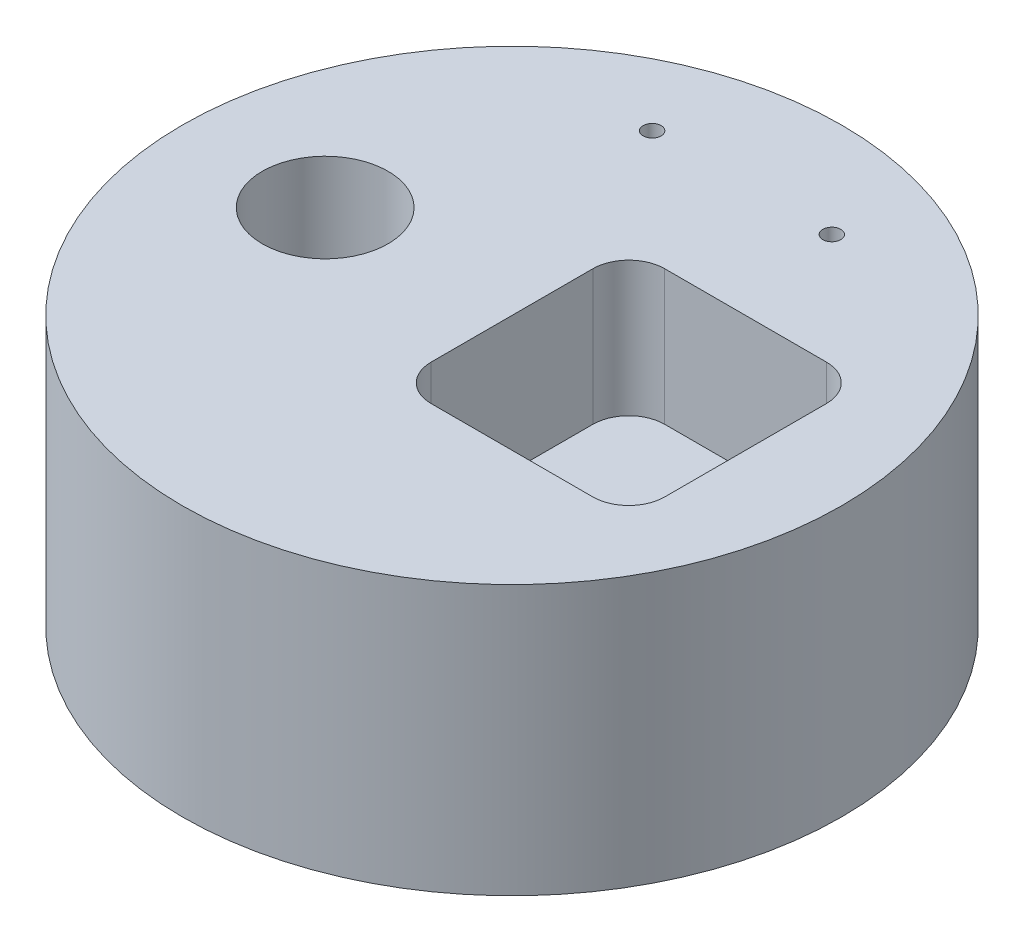
ISO-10303-21;
HEADER;
FILE_DESCRIPTION(('STEP AP214'),'2;1');
FILE_NAME('part.step','',(''),(''),'','','');
FILE_SCHEMA(('AUTOMOTIVE_DESIGN { 1 0 10303 214 1 1 1 1 }'));
ENDSEC;
DATA;
#1=APPLICATION_CONTEXT('core data for automotive mechanical design processes');
#2=APPLICATION_PROTOCOL_DEFINITION('international standard','automotive_design',2000,#1);
#3=PRODUCT_CONTEXT('',#1,'mechanical');
#4=PRODUCT('Part','Part','',(#3));
#5=PRODUCT_RELATED_PRODUCT_CATEGORY('part','',(#4));
#6=PRODUCT_DEFINITION_FORMATION('','',#4);
#7=PRODUCT_DEFINITION_CONTEXT('part definition',#1,'design');
#8=PRODUCT_DEFINITION('design','',#6,#7);
#9=PRODUCT_DEFINITION_SHAPE('','',#8);
#10=(LENGTH_UNIT() NAMED_UNIT(*) SI_UNIT(.MILLI.,.METRE.));
#11=(NAMED_UNIT(*) PLANE_ANGLE_UNIT() SI_UNIT($,.RADIAN.));
#12=(NAMED_UNIT(*) SI_UNIT($,.STERADIAN.) SOLID_ANGLE_UNIT());
#13=UNCERTAINTY_MEASURE_WITH_UNIT(LENGTH_MEASURE(1.E-05),#10,'distance_accuracy_value','');
#14=(GEOMETRIC_REPRESENTATION_CONTEXT(3) GLOBAL_UNCERTAINTY_ASSIGNED_CONTEXT((#13)) GLOBAL_UNIT_ASSIGNED_CONTEXT((#10,
#11,#12)) REPRESENTATION_CONTEXT('',''));
#15=CARTESIAN_POINT('',(0.,0.,0.));
#16=DIRECTION('',(0.,0.,1.));
#17=DIRECTION('',(1.,0.,0.));
#18=AXIS2_PLACEMENT_3D('',#15,#16,#17);
#19=CARTESIAN_POINT('',(0.,38.1,0.));
#20=DIRECTION('',(0.,-1.,0.));
#21=DIRECTION('',(0.,0.,-1.));
#22=AXIS2_PLACEMENT_3D('',#19,#20,#21);
#23=CYLINDRICAL_SURFACE('',#22,46.609);
#24=CARTESIAN_POINT('',(0.,38.1,0.));
#25=DIRECTION('',(0.,1.,0.));
#26=DIRECTION('',(0.,0.,1.));
#27=AXIS2_PLACEMENT_3D('',#24,#25,#26);
#28=CIRCLE('',#27,46.609);
#29=CARTESIAN_POINT('',(0.,38.1,46.609));
#30=VERTEX_POINT('',#29);
#31=EDGE_CURVE('E153',#30,#30,#28,.T.);
#32=ORIENTED_EDGE('',*,*,#31,.F.);
#33=EDGE_LOOP('',(#32));
#34=FACE_BOUND('',#33,.T.);
#35=CARTESIAN_POINT('',(0.,0.,0.));
#36=DIRECTION('',(0.,1.,0.));
#37=DIRECTION('',(0.,0.,1.));
#38=AXIS2_PLACEMENT_3D('',#35,#36,#37);
#39=CIRCLE('',#38,46.609);
#40=CARTESIAN_POINT('',(0.,0.,46.609));
#41=VERTEX_POINT('',#40);
#42=EDGE_CURVE('E148',#41,#41,#39,.T.);
#43=ORIENTED_EDGE('',*,*,#42,.T.);
#44=EDGE_LOOP('',(#43));
#45=FACE_BOUND('',#44,.T.);
#46=ADVANCED_FACE('F33',(#34,#45),#23,.T.);
#47=CARTESIAN_POINT('',(0.,38.1,0.));
#48=DIRECTION('',(0.,1.,0.));
#49=DIRECTION('',(0.,0.,1.));
#50=AXIS2_PLACEMENT_3D('',#47,#48,#49);
#51=PLANE('',#50);
#52=DIRECTION('',(0.,0.,1.));
#53=VECTOR('',#52,1.);
#54=CARTESIAN_POINT('',(0.,38.1,-16.51));
#55=LINE('',#54,#53);
#56=CARTESIAN_POINT('',(0.,38.1,-11.43));
#57=VERTEX_POINT('',#56);
#58=CARTESIAN_POINT('',(0.,38.1,11.43));
#59=VERTEX_POINT('',#58);
#60=EDGE_CURVE('E123',#57,#59,#55,.T.);
#61=ORIENTED_EDGE('',*,*,#60,.F.);
#62=CARTESIAN_POINT('',(5.08,38.1,-11.43));
#63=DIRECTION('',(0.,1.,0.));
#64=DIRECTION('',(0.,0.,1.));
#65=AXIS2_PLACEMENT_3D('',#62,#63,#64);
#66=CIRCLE('',#65,5.08);
#67=CARTESIAN_POINT('',(5.08,38.1,-16.51));
#68=VERTEX_POINT('',#67);
#69=EDGE_CURVE('E11',#57,#68,#66,.F.);
#70=ORIENTED_EDGE('',*,*,#69,.T.);
#71=DIRECTION('',(-1.,0.,0.));
#72=VECTOR('',#71,1.);
#73=CARTESIAN_POINT('',(0.,38.1,-16.51));
#74=LINE('',#73,#72);
#75=CARTESIAN_POINT('',(27.94,38.1,-16.51));
#76=VERTEX_POINT('',#75);
#77=EDGE_CURVE('E126',#76,#68,#74,.T.);
#78=ORIENTED_EDGE('',*,*,#77,.F.);
#79=CARTESIAN_POINT('',(27.94,38.1,-11.43));
#80=DIRECTION('',(0.,1.,0.));
#81=DIRECTION('',(0.,0.,1.));
#82=AXIS2_PLACEMENT_3D('',#79,#80,#81);
#83=CIRCLE('',#82,5.08);
#84=CARTESIAN_POINT('',(33.02,38.1,-11.43));
#85=VERTEX_POINT('',#84);
#86=EDGE_CURVE('E41',#76,#85,#83,.F.);
#87=ORIENTED_EDGE('',*,*,#86,.T.);
#88=DIRECTION('',(0.,0.,-1.));
#89=VECTOR('',#88,1.);
#90=CARTESIAN_POINT('',(33.02,38.1,-16.51));
#91=LINE('',#90,#89);
#92=CARTESIAN_POINT('',(33.02,38.1,11.43));
#93=VERTEX_POINT('',#92);
#94=EDGE_CURVE('E122',#93,#85,#91,.T.);
#95=ORIENTED_EDGE('',*,*,#94,.F.);
#96=CARTESIAN_POINT('',(27.94,38.1,11.43));
#97=DIRECTION('',(0.,1.,0.));
#98=DIRECTION('',(0.,0.,1.));
#99=AXIS2_PLACEMENT_3D('',#96,#97,#98);
#100=CIRCLE('',#99,5.08);
#101=CARTESIAN_POINT('',(27.94,38.1,16.51));
#102=VERTEX_POINT('',#101);
#103=EDGE_CURVE('E105',#93,#102,#100,.F.);
#104=ORIENTED_EDGE('',*,*,#103,.T.);
#105=DIRECTION('',(1.,0.,0.));
#106=VECTOR('',#105,1.);
#107=CARTESIAN_POINT('',(0.,38.1,16.51));
#108=LINE('',#107,#106);
#109=CARTESIAN_POINT('',(5.08,38.1,16.51));
#110=VERTEX_POINT('',#109);
#111=EDGE_CURVE('E112',#110,#102,#108,.T.);
#112=ORIENTED_EDGE('',*,*,#111,.F.);
#113=CARTESIAN_POINT('',(5.08,38.1,11.43));
#114=DIRECTION('',(0.,1.,0.));
#115=DIRECTION('',(0.,0.,1.));
#116=AXIS2_PLACEMENT_3D('',#113,#114,#115);
#117=CIRCLE('',#116,5.08);
#118=EDGE_CURVE('E97',#110,#59,#117,.F.);
#119=ORIENTED_EDGE('',*,*,#118,.T.);
#120=EDGE_LOOP('',(#61,#70,#78,#87,#95,#104,#112,#119));
#121=FACE_BOUND('',#120,.T.);
#122=CARTESIAN_POINT('',(-26.4099587944115,38.1,0.));
#123=DIRECTION('',(0.,1.,0.));
#124=DIRECTION('',(0.,0.,1.));
#125=AXIS2_PLACEMENT_3D('',#122,#123,#124);
#126=CIRCLE('',#125,8.89);
#127=CARTESIAN_POINT('',(-26.4099587944115,38.1,8.89));
#128=VERTEX_POINT('',#127);
#129=EDGE_CURVE('E133',#128,#128,#126,.T.);
#130=ORIENTED_EDGE('',*,*,#129,.F.);
#131=EDGE_LOOP('',(#130));
#132=FACE_BOUND('',#131,.T.);
#133=CARTESIAN_POINT('',(12.7,38.1,-32.512));
#134=DIRECTION('',(0.,1.,0.));
#135=DIRECTION('',(0.,0.,1.));
#136=AXIS2_PLACEMENT_3D('',#133,#134,#135);
#137=CIRCLE('',#136,1.27);
#138=CARTESIAN_POINT('',(12.7,38.1,-31.242));
#139=VERTEX_POINT('',#138);
#140=EDGE_CURVE('E141',#139,#139,#137,.T.);
#141=ORIENTED_EDGE('',*,*,#140,.F.);
#142=EDGE_LOOP('',(#141));
#143=FACE_BOUND('',#142,.T.);
#144=CARTESIAN_POINT('',(-12.7,38.1,-32.512));
#145=DIRECTION('',(0.,1.,0.));
#146=DIRECTION('',(0.,0.,1.));
#147=AXIS2_PLACEMENT_3D('',#144,#145,#146);
#148=CIRCLE('',#147,1.27);
#149=CARTESIAN_POINT('',(-12.7,38.1,-31.242));
#150=VERTEX_POINT('',#149);
#151=EDGE_CURVE('E140',#150,#150,#148,.T.);
#152=ORIENTED_EDGE('',*,*,#151,.F.);
#153=EDGE_LOOP('',(#152));
#154=FACE_BOUND('',#153,.T.);
#155=ORIENTED_EDGE('',*,*,#31,.T.);
#156=EDGE_LOOP('',(#155));
#157=FACE_BOUND('',#156,.T.);
#158=ADVANCED_FACE('F119',(#121,#132,#143,#154,#157),#51,.T.);
#159=CARTESIAN_POINT('',(0.,0.,0.));
#160=DIRECTION('',(0.,1.,0.));
#161=DIRECTION('',(0.,0.,1.));
#162=AXIS2_PLACEMENT_3D('',#159,#160,#161);
#163=PLANE('',#162);
#164=CARTESIAN_POINT('',(-26.4099587944115,0.,0.));
#165=DIRECTION('',(0.,1.,0.));
#166=DIRECTION('',(0.,0.,1.));
#167=AXIS2_PLACEMENT_3D('',#164,#165,#166);
#168=CIRCLE('',#167,8.89);
#169=CARTESIAN_POINT('',(-26.4099587944115,0.,8.89));
#170=VERTEX_POINT('',#169);
#171=EDGE_CURVE('E136',#170,#170,#168,.F.);
#172=ORIENTED_EDGE('',*,*,#171,.F.);
#173=EDGE_LOOP('',(#172));
#174=FACE_BOUND('',#173,.T.);
#175=CARTESIAN_POINT('',(12.7,0.,-32.512));
#176=DIRECTION('',(0.,1.,0.));
#177=DIRECTION('',(0.,0.,1.));
#178=AXIS2_PLACEMENT_3D('',#175,#176,#177);
#179=CIRCLE('',#178,1.27);
#180=CARTESIAN_POINT('',(12.7,0.,-31.242));
#181=VERTEX_POINT('',#180);
#182=EDGE_CURVE('E144',#181,#181,#179,.F.);
#183=ORIENTED_EDGE('',*,*,#182,.F.);
#184=EDGE_LOOP('',(#183));
#185=FACE_BOUND('',#184,.T.);
#186=CARTESIAN_POINT('',(-12.7,0.,-32.512));
#187=DIRECTION('',(0.,1.,0.));
#188=DIRECTION('',(0.,0.,1.));
#189=AXIS2_PLACEMENT_3D('',#186,#187,#188);
#190=CIRCLE('',#189,1.27);
#191=CARTESIAN_POINT('',(-12.7,0.,-31.242));
#192=VERTEX_POINT('',#191);
#193=EDGE_CURVE('E145',#192,#192,#190,.F.);
#194=ORIENTED_EDGE('',*,*,#193,.F.);
#195=EDGE_LOOP('',(#194));
#196=FACE_BOUND('',#195,.T.);
#197=ORIENTED_EDGE('',*,*,#42,.F.);
#198=EDGE_LOOP('',(#197));
#199=FACE_BOUND('',#198,.T.);
#200=ADVANCED_FACE('F214',(#174,#185,#196,#199),#163,.F.);
#201=CARTESIAN_POINT('',(-12.7,-3.59210244842766,-32.512));
#202=DIRECTION('',(0.,1.,0.));
#203=DIRECTION('',(0.,0.,1.));
#204=AXIS2_PLACEMENT_3D('',#201,#202,#203);
#205=CYLINDRICAL_SURFACE('',#204,1.27);
#206=ORIENTED_EDGE('',*,*,#193,.T.);
#207=EDGE_LOOP('',(#206));
#208=FACE_BOUND('',#207,.T.);
#209=ORIENTED_EDGE('',*,*,#151,.T.);
#210=EDGE_LOOP('',(#209));
#211=FACE_BOUND('',#210,.T.);
#212=ADVANCED_FACE('F300',(#208,#211),#205,.F.);
#213=CARTESIAN_POINT('',(12.7,-3.59210244842766,-32.512));
#214=DIRECTION('',(0.,1.,0.));
#215=DIRECTION('',(0.,0.,1.));
#216=AXIS2_PLACEMENT_3D('',#213,#214,#215);
#217=CYLINDRICAL_SURFACE('',#216,1.27);
#218=ORIENTED_EDGE('',*,*,#182,.T.);
#219=EDGE_LOOP('',(#218));
#220=FACE_BOUND('',#219,.T.);
#221=ORIENTED_EDGE('',*,*,#140,.T.);
#222=EDGE_LOOP('',(#221));
#223=FACE_BOUND('',#222,.T.);
#224=ADVANCED_FACE('F290',(#220,#223),#217,.F.);
#225=CARTESIAN_POINT('',(-26.4099587944115,-25.1447171389936,0.));
#226=DIRECTION('',(0.,1.,0.));
#227=DIRECTION('',(0.,0.,1.));
#228=AXIS2_PLACEMENT_3D('',#225,#226,#227);
#229=CYLINDRICAL_SURFACE('',#228,8.89);
#230=ORIENTED_EDGE('',*,*,#171,.T.);
#231=EDGE_LOOP('',(#230));
#232=FACE_BOUND('',#231,.T.);
#233=ORIENTED_EDGE('',*,*,#129,.T.);
#234=EDGE_LOOP('',(#233));
#235=FACE_BOUND('',#234,.T.);
#236=ADVANCED_FACE('F281',(#232,#235),#229,.F.);
#237=CARTESIAN_POINT('',(0.,19.05,-16.51));
#238=DIRECTION('',(-1.,0.,0.));
#239=DIRECTION('',(0.,0.,1.));
#240=AXIS2_PLACEMENT_3D('',#237,#238,#239);
#241=PLANE('',#240);
#242=ORIENTED_EDGE('',*,*,#60,.T.);
#243=DIRECTION('',(0.,1.,0.));
#244=VECTOR('',#243,1.);
#245=CARTESIAN_POINT('',(0.,19.05,11.43));
#246=LINE('',#245,#244);
#247=CARTESIAN_POINT('',(0.,19.05,11.43));
#248=VERTEX_POINT('',#247);
#249=EDGE_CURVE('E102',#59,#248,#246,.F.);
#250=ORIENTED_EDGE('',*,*,#249,.T.);
#251=DIRECTION('',(0.,0.,1.));
#252=VECTOR('',#251,1.);
#253=CARTESIAN_POINT('',(0.,19.05,-16.51));
#254=LINE('',#253,#252);
#255=CARTESIAN_POINT('',(0.,19.05,-11.43));
#256=VERTEX_POINT('',#255);
#257=EDGE_CURVE('E132',#256,#248,#254,.T.);
#258=ORIENTED_EDGE('',*,*,#257,.F.);
#259=DIRECTION('',(0.,1.,0.));
#260=VECTOR('',#259,1.);
#261=CARTESIAN_POINT('',(0.,38.1,-11.43));
#262=LINE('',#261,#260);
#263=EDGE_CURVE('E116',#256,#57,#262,.T.);
#264=ORIENTED_EDGE('',*,*,#263,.T.);
#265=EDGE_LOOP('',(#242,#250,#258,#264));
#266=FACE_BOUND('',#265,.T.);
#267=ADVANCED_FACE('F201',(#266),#241,.F.);
#268=CARTESIAN_POINT('',(0.,19.05,-16.51));
#269=DIRECTION('',(0.,0.,-1.));
#270=DIRECTION('',(-1.,0.,0.));
#271=AXIS2_PLACEMENT_3D('',#268,#269,#270);
#272=PLANE('',#271);
#273=DIRECTION('',(-1.,0.,0.));
#274=VECTOR('',#273,1.);
#275=CARTESIAN_POINT('',(0.,19.05,-16.51));
#276=LINE('',#275,#274);
#277=CARTESIAN_POINT('',(27.94,19.05,-16.51));
#278=VERTEX_POINT('',#277);
#279=CARTESIAN_POINT('',(5.08,19.05,-16.51));
#280=VERTEX_POINT('',#279);
#281=EDGE_CURVE('E137',#278,#280,#276,.T.);
#282=ORIENTED_EDGE('',*,*,#281,.F.);
#283=DIRECTION('',(0.,1.,0.));
#284=VECTOR('',#283,1.);
#285=CARTESIAN_POINT('',(27.94,38.1,-16.51));
#286=LINE('',#285,#284);
#287=EDGE_CURVE('E106',#278,#76,#286,.T.);
#288=ORIENTED_EDGE('',*,*,#287,.T.);
#289=ORIENTED_EDGE('',*,*,#77,.T.);
#290=DIRECTION('',(0.,1.,0.));
#291=VECTOR('',#290,1.);
#292=CARTESIAN_POINT('',(5.08,19.05,-16.51));
#293=LINE('',#292,#291);
#294=EDGE_CURVE('E175',#68,#280,#293,.F.);
#295=ORIENTED_EDGE('',*,*,#294,.T.);
#296=EDGE_LOOP('',(#282,#288,#289,#295));
#297=FACE_BOUND('',#296,.T.);
#298=ADVANCED_FACE('F193',(#297),#272,.F.);
#299=CARTESIAN_POINT('',(33.02,19.05,-16.51));
#300=DIRECTION('',(1.,0.,0.));
#301=DIRECTION('',(0.,0.,-1.));
#302=AXIS2_PLACEMENT_3D('',#299,#300,#301);
#303=PLANE('',#302);
#304=DIRECTION('',(0.,0.,-1.));
#305=VECTOR('',#304,1.);
#306=CARTESIAN_POINT('',(33.02,19.05,-16.51));
#307=LINE('',#306,#305);
#308=CARTESIAN_POINT('',(33.02,19.05,11.43));
#309=VERTEX_POINT('',#308);
#310=CARTESIAN_POINT('',(33.02,19.05,-11.43));
#311=VERTEX_POINT('',#310);
#312=EDGE_CURVE('E191',#309,#311,#307,.T.);
#313=ORIENTED_EDGE('',*,*,#312,.F.);
#314=DIRECTION('',(0.,1.,0.));
#315=VECTOR('',#314,1.);
#316=CARTESIAN_POINT('',(33.02,38.1,11.43));
#317=LINE('',#316,#315);
#318=EDGE_CURVE('E172',#309,#93,#317,.T.);
#319=ORIENTED_EDGE('',*,*,#318,.T.);
#320=ORIENTED_EDGE('',*,*,#94,.T.);
#321=DIRECTION('',(0.,1.,0.));
#322=VECTOR('',#321,1.);
#323=CARTESIAN_POINT('',(33.02,19.05,-11.43));
#324=LINE('',#323,#322);
#325=EDGE_CURVE('E170',#85,#311,#324,.F.);
#326=ORIENTED_EDGE('',*,*,#325,.T.);
#327=EDGE_LOOP('',(#313,#319,#320,#326));
#328=FACE_BOUND('',#327,.T.);
#329=ADVANCED_FACE('F180',(#328),#303,.F.);
#330=CARTESIAN_POINT('',(0.,19.05,16.51));
#331=DIRECTION('',(0.,0.,1.));
#332=DIRECTION('',(1.,0.,0.));
#333=AXIS2_PLACEMENT_3D('',#330,#331,#332);
#334=PLANE('',#333);
#335=DIRECTION('',(1.,0.,0.));
#336=VECTOR('',#335,1.);
#337=CARTESIAN_POINT('',(0.,19.05,16.51));
#338=LINE('',#337,#336);
#339=CARTESIAN_POINT('',(5.08,19.05,16.51));
#340=VERTEX_POINT('',#339);
#341=CARTESIAN_POINT('',(27.94,19.05,16.51));
#342=VERTEX_POINT('',#341);
#343=EDGE_CURVE('E115',#340,#342,#338,.T.);
#344=ORIENTED_EDGE('',*,*,#343,.F.);
#345=DIRECTION('',(0.,1.,0.));
#346=VECTOR('',#345,1.);
#347=CARTESIAN_POINT('',(5.08,38.1,16.51));
#348=LINE('',#347,#346);
#349=EDGE_CURVE('E101',#340,#110,#348,.T.);
#350=ORIENTED_EDGE('',*,*,#349,.T.);
#351=ORIENTED_EDGE('',*,*,#111,.T.);
#352=DIRECTION('',(0.,1.,0.));
#353=VECTOR('',#352,1.);
#354=CARTESIAN_POINT('',(27.94,19.05,16.51));
#355=LINE('',#354,#353);
#356=EDGE_CURVE('E117',#102,#342,#355,.F.);
#357=ORIENTED_EDGE('',*,*,#356,.T.);
#358=EDGE_LOOP('',(#344,#350,#351,#357));
#359=FACE_BOUND('',#358,.T.);
#360=ADVANCED_FACE('F111',(#359),#334,.F.);
#361=CARTESIAN_POINT('',(0.,19.05,0.));
#362=DIRECTION('',(0.,1.,0.));
#363=DIRECTION('',(0.,0.,1.));
#364=AXIS2_PLACEMENT_3D('',#361,#362,#363);
#365=PLANE('',#364);
#366=ORIENTED_EDGE('',*,*,#257,.T.);
#367=CARTESIAN_POINT('',(5.08,19.05,11.43));
#368=DIRECTION('',(0.,1.,0.));
#369=DIRECTION('',(0.,0.,1.));
#370=AXIS2_PLACEMENT_3D('',#367,#368,#369);
#371=CIRCLE('',#370,5.08);
#372=EDGE_CURVE('E168',#248,#340,#371,.T.);
#373=ORIENTED_EDGE('',*,*,#372,.T.);
#374=ORIENTED_EDGE('',*,*,#343,.T.);
#375=CARTESIAN_POINT('',(27.94,19.05,11.43));
#376=DIRECTION('',(0.,1.,0.));
#377=DIRECTION('',(0.,0.,1.));
#378=AXIS2_PLACEMENT_3D('',#375,#376,#377);
#379=CIRCLE('',#378,5.08);
#380=EDGE_CURVE('E166',#342,#309,#379,.T.);
#381=ORIENTED_EDGE('',*,*,#380,.T.);
#382=ORIENTED_EDGE('',*,*,#312,.T.);
#383=CARTESIAN_POINT('',(27.94,19.05,-11.43));
#384=DIRECTION('',(0.,1.,0.));
#385=DIRECTION('',(0.,0.,1.));
#386=AXIS2_PLACEMENT_3D('',#383,#384,#385);
#387=CIRCLE('',#386,5.08);
#388=EDGE_CURVE('E164',#311,#278,#387,.T.);
#389=ORIENTED_EDGE('',*,*,#388,.T.);
#390=ORIENTED_EDGE('',*,*,#281,.T.);
#391=CARTESIAN_POINT('',(5.08,19.05,-11.43));
#392=DIRECTION('',(0.,1.,0.));
#393=DIRECTION('',(0.,0.,1.));
#394=AXIS2_PLACEMENT_3D('',#391,#392,#393);
#395=CIRCLE('',#394,5.08);
#396=EDGE_CURVE('E162',#280,#256,#395,.T.);
#397=ORIENTED_EDGE('',*,*,#396,.T.);
#398=EDGE_LOOP('',(#366,#373,#374,#381,#382,#389,#390,#397));
#399=FACE_BOUND('',#398,.T.);
#400=ADVANCED_FACE('F189',(#399),#365,.T.);
#401=CARTESIAN_POINT('',(5.08,19.05,11.43));
#402=DIRECTION('',(0.,-1.,0.));
#403=DIRECTION('',(0.,0.,-1.));
#404=AXIS2_PLACEMENT_3D('',#401,#402,#403);
#405=CYLINDRICAL_SURFACE('',#404,5.08);
#406=ORIENTED_EDGE('',*,*,#372,.F.);
#407=ORIENTED_EDGE('',*,*,#249,.F.);
#408=ORIENTED_EDGE('',*,*,#118,.F.);
#409=ORIENTED_EDGE('',*,*,#349,.F.);
#410=EDGE_LOOP('',(#406,#407,#408,#409));
#411=FACE_BOUND('',#410,.T.);
#412=ADVANCED_FACE('F100',(#411),#405,.F.);
#413=CARTESIAN_POINT('',(27.94,19.05,11.43));
#414=DIRECTION('',(0.,-1.,0.));
#415=DIRECTION('',(0.,0.,-1.));
#416=AXIS2_PLACEMENT_3D('',#413,#414,#415);
#417=CYLINDRICAL_SURFACE('',#416,5.08);
#418=ORIENTED_EDGE('',*,*,#380,.F.);
#419=ORIENTED_EDGE('',*,*,#356,.F.);
#420=ORIENTED_EDGE('',*,*,#103,.F.);
#421=ORIENTED_EDGE('',*,*,#318,.F.);
#422=EDGE_LOOP('',(#418,#419,#420,#421));
#423=FACE_BOUND('',#422,.T.);
#424=ADVANCED_FACE('F207',(#423),#417,.F.);
#425=CARTESIAN_POINT('',(27.94,19.05,-11.43));
#426=DIRECTION('',(0.,-1.,0.));
#427=DIRECTION('',(0.,0.,-1.));
#428=AXIS2_PLACEMENT_3D('',#425,#426,#427);
#429=CYLINDRICAL_SURFACE('',#428,5.08);
#430=ORIENTED_EDGE('',*,*,#388,.F.);
#431=ORIENTED_EDGE('',*,*,#325,.F.);
#432=ORIENTED_EDGE('',*,*,#86,.F.);
#433=ORIENTED_EDGE('',*,*,#287,.F.);
#434=EDGE_LOOP('',(#430,#431,#432,#433));
#435=FACE_BOUND('',#434,.T.);
#436=ADVANCED_FACE('F184',(#435),#429,.F.);
#437=CARTESIAN_POINT('',(5.08,19.05,-11.43));
#438=DIRECTION('',(0.,-1.,0.));
#439=DIRECTION('',(0.,0.,-1.));
#440=AXIS2_PLACEMENT_3D('',#437,#438,#439);
#441=CYLINDRICAL_SURFACE('',#440,5.08);
#442=ORIENTED_EDGE('',*,*,#396,.F.);
#443=ORIENTED_EDGE('',*,*,#294,.F.);
#444=ORIENTED_EDGE('',*,*,#69,.F.);
#445=ORIENTED_EDGE('',*,*,#263,.F.);
#446=EDGE_LOOP('',(#442,#443,#444,#445));
#447=FACE_BOUND('',#446,.T.);
#448=ADVANCED_FACE('F35',(#447),#441,.F.);
#449=CLOSED_SHELL('',(#46,#158,#200,#212,#224,#236,#267,#298,#329,#360,#400,#412,#424,#436,#448));
#450=MANIFOLD_SOLID_BREP('B2',#449);
#451=ADVANCED_BREP_SHAPE_REPRESENTATION('',(#18,#450),#14);
#452=SHAPE_DEFINITION_REPRESENTATION(#9,#451);
ENDSEC;
END-ISO-10303-21;
